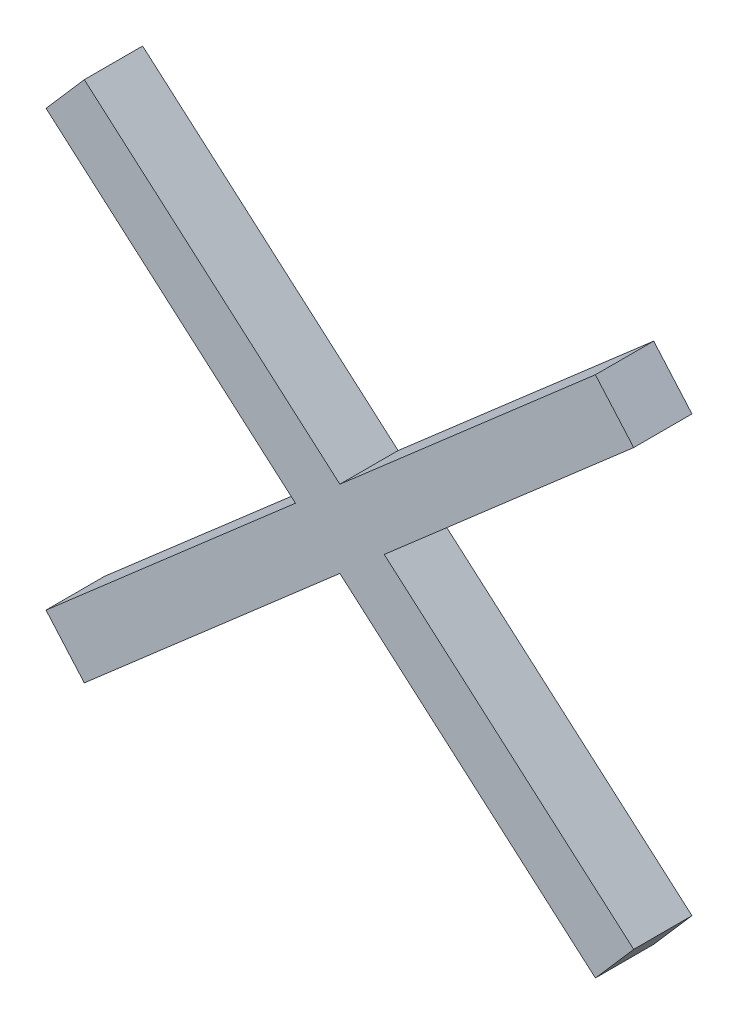
ISO-10303-21;
HEADER;
FILE_DESCRIPTION(('STEP AP214'),'2;1');
FILE_NAME('part.step','',(''),(''),'','','');
FILE_SCHEMA(('AUTOMOTIVE_DESIGN { 1 0 10303 214 1 1 1 1 }'));
ENDSEC;
DATA;
#1=APPLICATION_CONTEXT('core data for automotive mechanical design processes');
#2=APPLICATION_PROTOCOL_DEFINITION('international standard','automotive_design',2000,#1);
#3=PRODUCT_CONTEXT('',#1,'mechanical');
#4=PRODUCT('Part','Part','',(#3));
#5=PRODUCT_RELATED_PRODUCT_CATEGORY('part','',(#4));
#6=PRODUCT_DEFINITION_FORMATION('','',#4);
#7=PRODUCT_DEFINITION_CONTEXT('part definition',#1,'design');
#8=PRODUCT_DEFINITION('design','',#6,#7);
#9=PRODUCT_DEFINITION_SHAPE('','',#8);
#10=(LENGTH_UNIT() NAMED_UNIT(*) SI_UNIT(.MILLI.,.METRE.));
#11=(NAMED_UNIT(*) PLANE_ANGLE_UNIT() SI_UNIT($,.RADIAN.));
#12=(NAMED_UNIT(*) SI_UNIT($,.STERADIAN.) SOLID_ANGLE_UNIT());
#13=UNCERTAINTY_MEASURE_WITH_UNIT(LENGTH_MEASURE(1.E-05),#10,'distance_accuracy_value','');
#14=(GEOMETRIC_REPRESENTATION_CONTEXT(3) GLOBAL_UNCERTAINTY_ASSIGNED_CONTEXT((#13)) GLOBAL_UNIT_ASSIGNED_CONTEXT((#10,
#11,#12)) REPRESENTATION_CONTEXT('',''));
#15=CARTESIAN_POINT('',(0.,0.,0.));
#16=DIRECTION('',(0.,0.,1.));
#17=DIRECTION('',(1.,0.,0.));
#18=AXIS2_PLACEMENT_3D('',#15,#16,#17);
#19=CARTESIAN_POINT('',(-17.5384784075493,-17.9276818118777,4.));
#20=DIRECTION('',(-0.656780744804202,0.754081595886306,0.));
#21=DIRECTION('',(-0.754081595886306,-0.656780744804202,0.));
#22=AXIS2_PLACEMENT_3D('',#19,#20,#21);
#23=PLANE('',#22);
#24=DIRECTION('',(0.754081595886306,0.656780744804202,0.));
#25=VECTOR('',#24,1.);
#26=CARTESIAN_POINT('',(-17.5384784075493,-17.9276818118777,4.));
#27=LINE('',#26,#25);
#28=CARTESIAN_POINT('',(3.04515626534732,0.,4.));
#29=VERTEX_POINT('',#28);
#30=CARTESIAN_POINT('',(20.165601386766,14.9113554283324,4.));
#31=VERTEX_POINT('',#30);
#32=EDGE_CURVE('E210',#29,#31,#27,.T.);
#33=ORIENTED_EDGE('',*,*,#32,.F.);
#34=DIRECTION('',(0.,0.,-1.));
#35=VECTOR('',#34,1.);
#36=CARTESIAN_POINT('',(3.04515626534732,0.,4.));
#37=LINE('',#36,#35);
#38=CARTESIAN_POINT('',(3.04515626534732,0.,0.));
#39=VERTEX_POINT('',#38);
#40=EDGE_CURVE('E65',#29,#39,#37,.T.);
#41=ORIENTED_EDGE('',*,*,#40,.T.);
#42=DIRECTION('',(0.754081595886306,0.656780744804202,0.));
#43=VECTOR('',#42,1.);
#44=CARTESIAN_POINT('',(-17.5384784075493,-17.9276818118777,0.));
#45=LINE('',#44,#43);
#46=CARTESIAN_POINT('',(20.165601386766,14.9113554283324,0.));
#47=VERTEX_POINT('',#46);
#48=EDGE_CURVE('E202',#39,#47,#45,.T.);
#49=ORIENTED_EDGE('',*,*,#48,.T.);
#50=DIRECTION('',(0.,0.,-1.));
#51=VECTOR('',#50,1.);
#52=CARTESIAN_POINT('',(20.165601386766,14.9113554283324,4.));
#53=LINE('',#52,#51);
#54=EDGE_CURVE('E193',#31,#47,#53,.T.);
#55=ORIENTED_EDGE('',*,*,#54,.F.);
#56=EDGE_LOOP('',(#33,#41,#49,#55));
#57=FACE_BOUND('',#56,.T.);
#58=ADVANCED_FACE('F56',(#57),#23,.F.);
#59=CARTESIAN_POINT('',(20.165601386766,14.9113554283324,4.));
#60=DIRECTION('',(-0.754081595886305,-0.656780744804203,0.));
#61=DIRECTION('',(0.656780744804203,-0.754081595886305,0.));
#62=AXIS2_PLACEMENT_3D('',#59,#60,#61);
#63=PLANE('',#62);
#64=DIRECTION('',(-0.656780744804203,0.754081595886305,0.));
#65=VECTOR('',#64,1.);
#66=CARTESIAN_POINT('',(20.165601386766,14.9113554283324,0.));
#67=LINE('',#66,#65);
#68=CARTESIAN_POINT('',(17.5384784075492,17.9276818118776,0.));
#69=VERTEX_POINT('',#68);
#70=EDGE_CURVE('E203',#47,#69,#67,.T.);
#71=ORIENTED_EDGE('',*,*,#70,.T.);
#72=DIRECTION('',(0.,0.,-1.));
#73=VECTOR('',#72,1.);
#74=CARTESIAN_POINT('',(17.5384784075492,17.9276818118776,4.));
#75=LINE('',#74,#73);
#76=CARTESIAN_POINT('',(17.5384784075492,17.9276818118776,4.));
#77=VERTEX_POINT('',#76);
#78=EDGE_CURVE('E189',#77,#69,#75,.T.);
#79=ORIENTED_EDGE('',*,*,#78,.F.);
#80=DIRECTION('',(-0.656780744804203,0.754081595886305,0.));
#81=VECTOR('',#80,1.);
#82=CARTESIAN_POINT('',(20.165601386766,14.9113554283324,4.));
#83=LINE('',#82,#81);
#84=EDGE_CURVE('E211',#31,#77,#83,.T.);
#85=ORIENTED_EDGE('',*,*,#84,.F.);
#86=ORIENTED_EDGE('',*,*,#54,.T.);
#87=EDGE_LOOP('',(#71,#79,#85,#86));
#88=FACE_BOUND('',#87,.T.);
#89=ADVANCED_FACE('F229',(#88),#63,.F.);
#90=CARTESIAN_POINT('',(-20.1656013867661,-14.9113554283325,4.));
#91=DIRECTION('',(-0.656780744804202,0.754081595886306,0.));
#92=DIRECTION('',(-0.754081595886306,-0.656780744804202,0.));
#93=AXIS2_PLACEMENT_3D('',#90,#91,#92);
#94=PLANE('',#93);
#95=DIRECTION('',(0.,0.,-1.));
#96=VECTOR('',#95,1.);
#97=CARTESIAN_POINT('',(0.,2.65223287627026,4.));
#98=LINE('',#97,#96);
#99=CARTESIAN_POINT('',(0.,2.65223287627025,4.));
#100=VERTEX_POINT('',#99);
#101=CARTESIAN_POINT('',(0.,2.65223287627025,0.));
#102=VERTEX_POINT('',#101);
#103=EDGE_CURVE('E73',#100,#102,#98,.T.);
#104=ORIENTED_EDGE('',*,*,#103,.F.);
#105=DIRECTION('',(0.754081595886306,0.656780744804202,0.));
#106=VECTOR('',#105,1.);
#107=CARTESIAN_POINT('',(-20.1656013867661,-14.9113554283325,4.));
#108=LINE('',#107,#106);
#109=EDGE_CURVE('E215',#100,#77,#108,.T.);
#110=ORIENTED_EDGE('',*,*,#109,.T.);
#111=ORIENTED_EDGE('',*,*,#78,.T.);
#112=DIRECTION('',(0.754081595886306,0.656780744804202,0.));
#113=VECTOR('',#112,1.);
#114=CARTESIAN_POINT('',(-20.1656013867661,-14.9113554283325,0.));
#115=LINE('',#114,#113);
#116=EDGE_CURVE('E207',#102,#69,#115,.T.);
#117=ORIENTED_EDGE('',*,*,#116,.F.);
#118=EDGE_LOOP('',(#104,#110,#111,#117));
#119=FACE_BOUND('',#118,.T.);
#120=ADVANCED_FACE('F219',(#119),#94,.T.);
#121=CARTESIAN_POINT('',(-20.1656013867661,-14.9113554283325,0.));
#122=DIRECTION('',(0.,0.,-1.));
#123=DIRECTION('',(-1.,0.,0.));
#124=AXIS2_PLACEMENT_3D('',#121,#122,#123);
#125=PLANE('',#124);
#126=ORIENTED_EDGE('',*,*,#48,.F.);
#127=DIRECTION('',(0.754081595886306,-0.656780744804202,0.));
#128=VECTOR('',#127,1.);
#129=CARTESIAN_POINT('',(-17.5384784075493,17.9276818118777,0.));
#130=LINE('',#129,#128);
#131=CARTESIAN_POINT('',(20.165601386766,-14.9113554283324,0.));
#132=VERTEX_POINT('',#131);
#133=EDGE_CURVE('E137',#39,#132,#130,.T.);
#134=ORIENTED_EDGE('',*,*,#133,.T.);
#135=DIRECTION('',(0.656780744804201,0.754081595886306,0.));
#136=VECTOR('',#135,1.);
#137=CARTESIAN_POINT('',(17.5384784075492,-17.9276818118776,0.));
#138=LINE('',#137,#136);
#139=CARTESIAN_POINT('',(17.5384784075492,-17.9276818118776,0.));
#140=VERTEX_POINT('',#139);
#141=EDGE_CURVE('E144',#140,#132,#138,.T.);
#142=ORIENTED_EDGE('',*,*,#141,.F.);
#143=DIRECTION('',(0.754081595886306,-0.656780744804202,0.));
#144=VECTOR('',#143,1.);
#145=CARTESIAN_POINT('',(-20.1656013867661,14.9113554283324,0.));
#146=LINE('',#145,#144);
#147=CARTESIAN_POINT('',(0.,-2.65223287627026,0.));
#148=VERTEX_POINT('',#147);
#149=EDGE_CURVE('E103',#148,#140,#146,.T.);
#150=ORIENTED_EDGE('',*,*,#149,.F.);
#151=CARTESIAN_POINT('',(-17.5384784075493,-17.9276818118777,0.));
#152=VERTEX_POINT('',#151);
#153=EDGE_CURVE('E198',#152,#148,#45,.T.);
#154=ORIENTED_EDGE('',*,*,#153,.F.);
#155=DIRECTION('',(-0.656780744804202,0.754081595886306,0.));
#156=VECTOR('',#155,1.);
#157=CARTESIAN_POINT('',(-17.5384784075493,-17.9276818118777,0.));
#158=LINE('',#157,#156);
#159=CARTESIAN_POINT('',(-20.1656013867661,-14.9113554283325,0.));
#160=VERTEX_POINT('',#159);
#161=EDGE_CURVE('E121',#152,#160,#158,.T.);
#162=ORIENTED_EDGE('',*,*,#161,.T.);
#163=CARTESIAN_POINT('',(-3.04515626534734,0.,0.));
#164=VERTEX_POINT('',#163);
#165=EDGE_CURVE('E132',#160,#164,#115,.T.);
#166=ORIENTED_EDGE('',*,*,#165,.T.);
#167=CARTESIAN_POINT('',(-20.1656013867661,14.9113554283324,0.));
#168=VERTEX_POINT('',#167);
#169=EDGE_CURVE('E113',#168,#164,#146,.T.);
#170=ORIENTED_EDGE('',*,*,#169,.F.);
#171=DIRECTION('',(0.656780744804201,0.754081595886306,0.));
#172=VECTOR('',#171,1.);
#173=CARTESIAN_POINT('',(-20.1656013867661,14.9113554283324,0.));
#174=LINE('',#173,#172);
#175=CARTESIAN_POINT('',(-17.5384784075493,17.9276818118777,0.));
#176=VERTEX_POINT('',#175);
#177=EDGE_CURVE('E129',#168,#176,#174,.T.);
#178=ORIENTED_EDGE('',*,*,#177,.T.);
#179=EDGE_CURVE('E139',#176,#102,#130,.T.);
#180=ORIENTED_EDGE('',*,*,#179,.T.);
#181=ORIENTED_EDGE('',*,*,#116,.T.);
#182=ORIENTED_EDGE('',*,*,#70,.F.);
#183=EDGE_LOOP('',(#126,#134,#142,#150,#154,#162,#166,#170,#178,#180,#181,#182));
#184=FACE_BOUND('',#183,.T.);
#185=ADVANCED_FACE('F127',(#184),#125,.T.);
#186=CARTESIAN_POINT('',(-20.1656013867661,-14.9113554283325,4.));
#187=DIRECTION('',(0.,0.,-1.));
#188=DIRECTION('',(-1.,0.,0.));
#189=AXIS2_PLACEMENT_3D('',#186,#187,#188);
#190=PLANE('',#189);
#191=ORIENTED_EDGE('',*,*,#109,.F.);
#192=DIRECTION('',(0.754081595886306,-0.656780744804202,0.));
#193=VECTOR('',#192,1.);
#194=CARTESIAN_POINT('',(-17.5384784075493,17.9276818118777,4.));
#195=LINE('',#194,#193);
#196=CARTESIAN_POINT('',(-17.5384784075493,17.9276818118777,4.));
#197=VERTEX_POINT('',#196);
#198=EDGE_CURVE('E178',#197,#100,#195,.T.);
#199=ORIENTED_EDGE('',*,*,#198,.F.);
#200=DIRECTION('',(0.656780744804201,0.754081595886306,0.));
#201=VECTOR('',#200,1.);
#202=CARTESIAN_POINT('',(-20.1656013867661,14.9113554283324,4.));
#203=LINE('',#202,#201);
#204=CARTESIAN_POINT('',(-20.1656013867661,14.9113554283324,4.));
#205=VERTEX_POINT('',#204);
#206=EDGE_CURVE('E133',#205,#197,#203,.T.);
#207=ORIENTED_EDGE('',*,*,#206,.F.);
#208=DIRECTION('',(0.754081595886306,-0.656780744804202,0.));
#209=VECTOR('',#208,1.);
#210=CARTESIAN_POINT('',(-20.1656013867661,14.9113554283324,4.));
#211=LINE('',#210,#209);
#212=CARTESIAN_POINT('',(-3.04515626534734,0.,4.));
#213=VERTEX_POINT('',#212);
#214=EDGE_CURVE('E116',#205,#213,#211,.T.);
#215=ORIENTED_EDGE('',*,*,#214,.T.);
#216=CARTESIAN_POINT('',(-20.1656013867661,-14.9113554283325,4.));
#217=VERTEX_POINT('',#216);
#218=EDGE_CURVE('E162',#217,#213,#108,.T.);
#219=ORIENTED_EDGE('',*,*,#218,.F.);
#220=DIRECTION('',(-0.656780744804202,0.754081595886306,0.));
#221=VECTOR('',#220,1.);
#222=CARTESIAN_POINT('',(-17.5384784075493,-17.9276818118777,4.));
#223=LINE('',#222,#221);
#224=CARTESIAN_POINT('',(-17.5384784075493,-17.9276818118777,4.));
#225=VERTEX_POINT('',#224);
#226=EDGE_CURVE('E201',#225,#217,#223,.T.);
#227=ORIENTED_EDGE('',*,*,#226,.F.);
#228=CARTESIAN_POINT('',(0.,-2.65223287627026,4.));
#229=VERTEX_POINT('',#228);
#230=EDGE_CURVE('E190',#225,#229,#27,.T.);
#231=ORIENTED_EDGE('',*,*,#230,.T.);
#232=CARTESIAN_POINT('',(17.5384784075492,-17.9276818118776,4.));
#233=VERTEX_POINT('',#232);
#234=EDGE_CURVE('E173',#229,#233,#211,.T.);
#235=ORIENTED_EDGE('',*,*,#234,.T.);
#236=DIRECTION('',(0.656780744804201,0.754081595886306,0.));
#237=VECTOR('',#236,1.);
#238=CARTESIAN_POINT('',(17.5384784075492,-17.9276818118776,4.));
#239=LINE('',#238,#237);
#240=CARTESIAN_POINT('',(20.165601386766,-14.9113554283324,4.));
#241=VERTEX_POINT('',#240);
#242=EDGE_CURVE('E174',#233,#241,#239,.T.);
#243=ORIENTED_EDGE('',*,*,#242,.T.);
#244=EDGE_CURVE('E182',#29,#241,#195,.T.);
#245=ORIENTED_EDGE('',*,*,#244,.F.);
#246=ORIENTED_EDGE('',*,*,#32,.T.);
#247=ORIENTED_EDGE('',*,*,#84,.T.);
#248=EDGE_LOOP('',(#191,#199,#207,#215,#219,#227,#231,#235,#243,#245,#246,#247));
#249=FACE_BOUND('',#248,.T.);
#250=ADVANCED_FACE('F168',(#249),#190,.F.);
#251=CARTESIAN_POINT('',(-17.5384784075493,-17.9276818118777,4.));
#252=DIRECTION('',(-0.754081595886306,-0.656780744804202,0.));
#253=DIRECTION('',(0.656780744804202,-0.754081595886306,0.));
#254=AXIS2_PLACEMENT_3D('',#251,#252,#253);
#255=PLANE('',#254);
#256=ORIENTED_EDGE('',*,*,#161,.F.);
#257=DIRECTION('',(0.,0.,-1.));
#258=VECTOR('',#257,1.);
#259=CARTESIAN_POINT('',(-17.5384784075493,-17.9276818118777,4.));
#260=LINE('',#259,#258);
#261=EDGE_CURVE('E154',#225,#152,#260,.T.);
#262=ORIENTED_EDGE('',*,*,#261,.F.);
#263=ORIENTED_EDGE('',*,*,#226,.T.);
#264=DIRECTION('',(0.,0.,-1.));
#265=VECTOR('',#264,1.);
#266=CARTESIAN_POINT('',(-20.1656013867661,-14.9113554283325,4.));
#267=LINE('',#266,#265);
#268=EDGE_CURVE('E186',#217,#160,#267,.T.);
#269=ORIENTED_EDGE('',*,*,#268,.T.);
#270=EDGE_LOOP('',(#256,#262,#263,#269));
#271=FACE_BOUND('',#270,.T.);
#272=ADVANCED_FACE('F256',(#271),#255,.T.);
#273=DIRECTION('',(0.,0.,-1.));
#274=VECTOR('',#273,1.);
#275=CARTESIAN_POINT('',(0.,-2.65223287627026,4.));
#276=LINE('',#275,#274);
#277=EDGE_CURVE('E12',#229,#148,#276,.T.);
#278=ORIENTED_EDGE('',*,*,#277,.F.);
#279=ORIENTED_EDGE('',*,*,#230,.F.);
#280=ORIENTED_EDGE('',*,*,#261,.T.);
#281=ORIENTED_EDGE('',*,*,#153,.T.);
#282=EDGE_LOOP('',(#278,#279,#280,#281));
#283=FACE_BOUND('',#282,.T.);
#284=ADVANCED_FACE('F261',(#283),#23,.F.);
#285=ORIENTED_EDGE('',*,*,#218,.T.);
#286=DIRECTION('',(0.,0.,-1.));
#287=VECTOR('',#286,1.);
#288=CARTESIAN_POINT('',(-3.04515626534734,0.,4.));
#289=LINE('',#288,#287);
#290=EDGE_CURVE('E153',#213,#164,#289,.T.);
#291=ORIENTED_EDGE('',*,*,#290,.T.);
#292=ORIENTED_EDGE('',*,*,#165,.F.);
#293=ORIENTED_EDGE('',*,*,#268,.F.);
#294=EDGE_LOOP('',(#285,#291,#292,#293));
#295=FACE_BOUND('',#294,.T.);
#296=ADVANCED_FACE('F159',(#295),#94,.T.);
#297=CARTESIAN_POINT('',(-20.1656013867661,14.9113554283324,4.));
#298=DIRECTION('',(-0.754081595886306,0.656780744804201,0.));
#299=DIRECTION('',(-0.656780744804201,-0.754081595886306,0.));
#300=AXIS2_PLACEMENT_3D('',#297,#298,#299);
#301=PLANE('',#300);
#302=ORIENTED_EDGE('',*,*,#177,.F.);
#303=DIRECTION('',(0.,0.,-1.));
#304=VECTOR('',#303,1.);
#305=CARTESIAN_POINT('',(-20.1656013867661,14.9113554283324,4.));
#306=LINE('',#305,#304);
#307=EDGE_CURVE('E109',#205,#168,#306,.T.);
#308=ORIENTED_EDGE('',*,*,#307,.F.);
#309=ORIENTED_EDGE('',*,*,#206,.T.);
#310=DIRECTION('',(0.,0.,-1.));
#311=VECTOR('',#310,1.);
#312=CARTESIAN_POINT('',(-17.5384784075493,17.9276818118777,4.));
#313=LINE('',#312,#311);
#314=EDGE_CURVE('E135',#197,#176,#313,.T.);
#315=ORIENTED_EDGE('',*,*,#314,.T.);
#316=EDGE_LOOP('',(#302,#308,#309,#315));
#317=FACE_BOUND('',#316,.T.);
#318=ADVANCED_FACE('F58',(#317),#301,.T.);
#319=CARTESIAN_POINT('',(-20.1656013867661,14.9113554283324,4.));
#320=DIRECTION('',(0.656780744804202,0.754081595886306,0.));
#321=DIRECTION('',(-0.754081595886306,0.656780744804202,0.));
#322=AXIS2_PLACEMENT_3D('',#319,#320,#321);
#323=PLANE('',#322);
#324=ORIENTED_EDGE('',*,*,#290,.F.);
#325=ORIENTED_EDGE('',*,*,#214,.F.);
#326=ORIENTED_EDGE('',*,*,#307,.T.);
#327=ORIENTED_EDGE('',*,*,#169,.T.);
#328=EDGE_LOOP('',(#324,#325,#326,#327));
#329=FACE_BOUND('',#328,.T.);
#330=ADVANCED_FACE('F111',(#329),#323,.F.);
#331=CARTESIAN_POINT('',(-17.5384784075493,17.9276818118777,4.));
#332=DIRECTION('',(0.656780744804202,0.754081595886306,0.));
#333=DIRECTION('',(-0.754081595886306,0.656780744804202,0.));
#334=AXIS2_PLACEMENT_3D('',#331,#332,#333);
#335=PLANE('',#334);
#336=ORIENTED_EDGE('',*,*,#198,.T.);
#337=ORIENTED_EDGE('',*,*,#103,.T.);
#338=ORIENTED_EDGE('',*,*,#179,.F.);
#339=ORIENTED_EDGE('',*,*,#314,.F.);
#340=EDGE_LOOP('',(#336,#337,#338,#339));
#341=FACE_BOUND('',#340,.T.);
#342=ADVANCED_FACE('F271',(#341),#335,.T.);
#343=ORIENTED_EDGE('',*,*,#234,.F.);
#344=ORIENTED_EDGE('',*,*,#277,.T.);
#345=ORIENTED_EDGE('',*,*,#149,.T.);
#346=DIRECTION('',(0.,0.,-1.));
#347=VECTOR('',#346,1.);
#348=CARTESIAN_POINT('',(17.5384784075492,-17.9276818118776,4.));
#349=LINE('',#348,#347);
#350=EDGE_CURVE('E122',#233,#140,#349,.T.);
#351=ORIENTED_EDGE('',*,*,#350,.F.);
#352=EDGE_LOOP('',(#343,#344,#345,#351));
#353=FACE_BOUND('',#352,.T.);
#354=ADVANCED_FACE('F262',(#353),#323,.F.);
#355=CARTESIAN_POINT('',(17.5384784075492,-17.9276818118776,4.));
#356=DIRECTION('',(-0.754081595886306,0.656780744804201,0.));
#357=DIRECTION('',(-0.656780744804201,-0.754081595886306,0.));
#358=AXIS2_PLACEMENT_3D('',#355,#356,#357);
#359=PLANE('',#358);
#360=ORIENTED_EDGE('',*,*,#141,.T.);
#361=DIRECTION('',(0.,0.,-1.));
#362=VECTOR('',#361,1.);
#363=CARTESIAN_POINT('',(20.165601386766,-14.9113554283324,4.));
#364=LINE('',#363,#362);
#365=EDGE_CURVE('E148',#241,#132,#364,.T.);
#366=ORIENTED_EDGE('',*,*,#365,.F.);
#367=ORIENTED_EDGE('',*,*,#242,.F.);
#368=ORIENTED_EDGE('',*,*,#350,.T.);
#369=EDGE_LOOP('',(#360,#366,#367,#368));
#370=FACE_BOUND('',#369,.T.);
#371=ADVANCED_FACE('F264',(#370),#359,.F.);
#372=ORIENTED_EDGE('',*,*,#40,.F.);
#373=ORIENTED_EDGE('',*,*,#244,.T.);
#374=ORIENTED_EDGE('',*,*,#365,.T.);
#375=ORIENTED_EDGE('',*,*,#133,.F.);
#376=EDGE_LOOP('',(#372,#373,#374,#375));
#377=FACE_BOUND('',#376,.T.);
#378=ADVANCED_FACE('F251',(#377),#335,.T.);
#379=CLOSED_SHELL('',(#58,#89,#120,#185,#250,#272,#284,#296,#318,#330,#342,#354,#371,#378));
#380=MANIFOLD_SOLID_BREP('B2',#379);
#381=ADVANCED_BREP_SHAPE_REPRESENTATION('',(#18,#380),#14);
#382=SHAPE_DEFINITION_REPRESENTATION(#9,#381);
ENDSEC;
END-ISO-10303-21;
